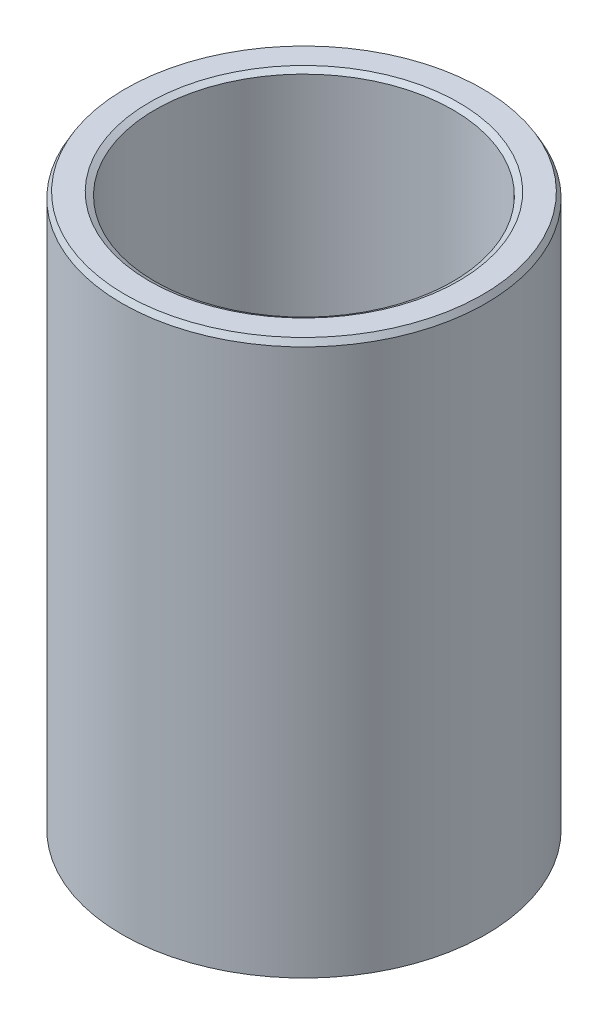
ISO-10303-21;
HEADER;
FILE_DESCRIPTION(('STEP AP214'),'2;1');
FILE_NAME('part.step','',(''),(''),'','','');
FILE_SCHEMA(('AUTOMOTIVE_DESIGN { 1 0 10303 214 1 1 1 1 }'));
ENDSEC;
DATA;
#1=APPLICATION_CONTEXT('core data for automotive mechanical design processes');
#2=APPLICATION_PROTOCOL_DEFINITION('international standard','automotive_design',2000,#1);
#3=PRODUCT_CONTEXT('',#1,'mechanical');
#4=PRODUCT('Part','Part','',(#3));
#5=PRODUCT_RELATED_PRODUCT_CATEGORY('part','',(#4));
#6=PRODUCT_DEFINITION_FORMATION('','',#4);
#7=PRODUCT_DEFINITION_CONTEXT('part definition',#1,'design');
#8=PRODUCT_DEFINITION('design','',#6,#7);
#9=PRODUCT_DEFINITION_SHAPE('','',#8);
#10=(LENGTH_UNIT() NAMED_UNIT(*) SI_UNIT(.MILLI.,.METRE.));
#11=(NAMED_UNIT(*) PLANE_ANGLE_UNIT() SI_UNIT($,.RADIAN.));
#12=(NAMED_UNIT(*) SI_UNIT($,.STERADIAN.) SOLID_ANGLE_UNIT());
#13=UNCERTAINTY_MEASURE_WITH_UNIT(LENGTH_MEASURE(1.E-05),#10,'distance_accuracy_value','');
#14=(GEOMETRIC_REPRESENTATION_CONTEXT(3) GLOBAL_UNCERTAINTY_ASSIGNED_CONTEXT((#13)) GLOBAL_UNIT_ASSIGNED_CONTEXT((#10,
#11,#12)) REPRESENTATION_CONTEXT('',''));
#15=CARTESIAN_POINT('',(0.,0.,0.));
#16=DIRECTION('',(0.,0.,1.));
#17=DIRECTION('',(1.,0.,0.));
#18=AXIS2_PLACEMENT_3D('',#15,#16,#17);
#19=CARTESIAN_POINT('',(0.,129.873883917508,0.));
#20=DIRECTION('',(0.,-1.,0.));
#21=DIRECTION('',(0.,0.,-1.));
#22=AXIS2_PLACEMENT_3D('',#19,#20,#21);
#23=CYLINDRICAL_SURFACE('',#22,42.5);
#24=CARTESIAN_POINT('',(0.,0.78767571603483,0.));
#25=DIRECTION('',(0.,1.,0.));
#26=DIRECTION('',(0.,0.,1.));
#27=AXIS2_PLACEMENT_3D('',#24,#25,#26);
#28=CIRCLE('',#27,42.5);
#29=CARTESIAN_POINT('',(0.,0.78767571603483,42.5));
#30=VERTEX_POINT('',#29);
#31=EDGE_CURVE('E10',#30,#30,#28,.T.);
#32=ORIENTED_EDGE('',*,*,#31,.T.);
#33=EDGE_LOOP('',(#32));
#34=FACE_BOUND('',#33,.T.);
#35=CARTESIAN_POINT('',(0.,128.509589557448,0.));
#36=DIRECTION('',(0.,1.,0.));
#37=DIRECTION('',(0.,0.,1.));
#38=AXIS2_PLACEMENT_3D('',#35,#36,#37);
#39=CIRCLE('',#38,42.5);
#40=CARTESIAN_POINT('',(0.,128.509589557448,42.5));
#41=VERTEX_POINT('',#40);
#42=EDGE_CURVE('E50',#41,#41,#39,.F.);
#43=ORIENTED_EDGE('',*,*,#42,.T.);
#44=EDGE_LOOP('',(#43));
#45=FACE_BOUND('',#44,.T.);
#46=ADVANCED_FACE('F39',(#34,#45),#23,.T.);
#47=CARTESIAN_POINT('',(0.,129.873883917508,0.));
#48=DIRECTION('',(0.,1.,0.));
#49=DIRECTION('',(0.,0.,1.));
#50=AXIS2_PLACEMENT_3D('',#47,#48,#49);
#51=PLANE('',#50);
#52=CARTESIAN_POINT('',(0.,129.873883917508,0.));
#53=DIRECTION('',(0.,1.,0.));
#54=DIRECTION('',(0.,0.,1.));
#55=AXIS2_PLACEMENT_3D('',#52,#53,#54);
#56=CIRCLE('',#55,36.1468698054226);
#57=CARTESIAN_POINT('',(0.,129.873883917508,36.1468698054226));
#58=VERTEX_POINT('',#57);
#59=EDGE_CURVE('E58',#58,#58,#56,.F.);
#60=ORIENTED_EDGE('',*,*,#59,.T.);
#61=EDGE_LOOP('',(#60));
#62=FACE_BOUND('',#61,.T.);
#63=CARTESIAN_POINT('',(0.,129.873883917508,0.));
#64=DIRECTION('',(0.,1.,0.));
#65=DIRECTION('',(0.,0.,1.));
#66=AXIS2_PLACEMENT_3D('',#63,#64,#65);
#67=CIRCLE('',#66,41.7123242839652);
#68=CARTESIAN_POINT('',(0.,129.873883917508,41.7123242839652));
#69=VERTEX_POINT('',#68);
#70=EDGE_CURVE('E61',#69,#69,#67,.T.);
#71=ORIENTED_EDGE('',*,*,#70,.T.);
#72=EDGE_LOOP('',(#71));
#73=FACE_BOUND('',#72,.T.);
#74=ADVANCED_FACE('F88',(#62,#73),#51,.T.);
#75=CARTESIAN_POINT('',(0.,0.,0.));
#76=DIRECTION('',(0.,1.,0.));
#77=DIRECTION('',(0.,0.,1.));
#78=AXIS2_PLACEMENT_3D('',#75,#76,#77);
#79=PLANE('',#78);
#80=CARTESIAN_POINT('',(0.,0.,0.));
#81=DIRECTION('',(0.,1.,0.));
#82=DIRECTION('',(0.,0.,1.));
#83=AXIS2_PLACEMENT_3D('',#80,#81,#82);
#84=CIRCLE('',#83,35.5702511613969);
#85=CARTESIAN_POINT('',(0.,0.,-35.5702511613969));
#86=VERTEX_POINT('',#85);
#87=EDGE_CURVE('E51',#86,#86,#84,.T.);
#88=ORIENTED_EDGE('',*,*,#87,.T.);
#89=EDGE_LOOP('',(#88));
#90=FACE_BOUND('',#89,.T.);
#91=CARTESIAN_POINT('',(0.,0.,0.));
#92=DIRECTION('',(0.,1.,0.));
#93=DIRECTION('',(0.,0.,1.));
#94=AXIS2_PLACEMENT_3D('',#91,#92,#93);
#95=CIRCLE('',#94,41.1357056399395);
#96=CARTESIAN_POINT('',(0.,0.,41.1357056399395));
#97=VERTEX_POINT('',#96);
#98=EDGE_CURVE('E54',#97,#97,#95,.F.);
#99=ORIENTED_EDGE('',*,*,#98,.T.);
#100=EDGE_LOOP('',(#99));
#101=FACE_BOUND('',#100,.T.);
#102=ADVANCED_FACE('F83',(#90,#101),#79,.F.);
#103=CARTESIAN_POINT('',(0.,129.873883917508,0.));
#104=DIRECTION('',(0.,-1.,0.));
#105=DIRECTION('',(0.,0.,-1.));
#106=AXIS2_PLACEMENT_3D('',#103,#104,#105);
#107=CYLINDRICAL_SURFACE('',#106,34.782575445362);
#108=CARTESIAN_POINT('',(0.,129.086208201473,0.));
#109=DIRECTION('',(0.,1.,0.));
#110=DIRECTION('',(0.,0.,1.));
#111=AXIS2_PLACEMENT_3D('',#108,#109,#110);
#112=CIRCLE('',#111,34.782575445362);
#113=CARTESIAN_POINT('',(0.,129.086208201473,34.782575445362));
#114=VERTEX_POINT('',#113);
#115=EDGE_CURVE('E67',#114,#114,#112,.T.);
#116=ORIENTED_EDGE('',*,*,#115,.T.);
#117=EDGE_LOOP('',(#116));
#118=FACE_BOUND('',#117,.T.);
#119=CARTESIAN_POINT('',(0.,1.36429436006055,0.));
#120=DIRECTION('',(0.,1.,0.));
#121=DIRECTION('',(0.,0.,1.));
#122=AXIS2_PLACEMENT_3D('',#119,#120,#121);
#123=CIRCLE('',#122,34.782575445362);
#124=CARTESIAN_POINT('',(0.,1.36429436006055,-34.782575445362));
#125=VERTEX_POINT('',#124);
#126=EDGE_CURVE('E69',#125,#125,#123,.F.);
#127=ORIENTED_EDGE('',*,*,#126,.T.);
#128=EDGE_LOOP('',(#127));
#129=FACE_BOUND('',#128,.T.);
#130=ADVANCED_FACE('F71',(#118,#129),#107,.F.);
#131=CARTESIAN_POINT('',(0.,129.086208201473,0.));
#132=DIRECTION('',(0.,1.,0.));
#133=DIRECTION('',(0.,0.,1.));
#134=AXIS2_PLACEMENT_3D('',#131,#132,#133);
#135=CONICAL_SURFACE('',#134,34.782575445362,1.0471975511966);
#136=ORIENTED_EDGE('',*,*,#59,.F.);
#137=EDGE_LOOP('',(#136));
#138=FACE_BOUND('',#137,.T.);
#139=ORIENTED_EDGE('',*,*,#115,.F.);
#140=EDGE_LOOP('',(#139));
#141=FACE_BOUND('',#140,.T.);
#142=ADVANCED_FACE('F77',(#138,#141),#135,.F.);
#143=CARTESIAN_POINT('',(0.,0.,0.));
#144=DIRECTION('',(0.,-1.,0.));
#145=DIRECTION('',(0.,0.,-1.));
#146=AXIS2_PLACEMENT_3D('',#143,#144,#145);
#147=CONICAL_SURFACE('',#146,35.5702511613969,0.523598775598296);
#148=CARTESIAN_POINT('',(0.,1.36429436006055,-34.782575445362));
#149=CARTESIAN_POINT('',(0.,1.35008296047659,-34.7907804007374));
#150=CARTESIAN_POINT('',(0.,1.33587156089262,-34.7989853561127));
#151=CARTESIAN_POINT('',(0.,1.3074487617247,-34.8153952668635));
#152=CARTESIAN_POINT('',(0.,1.29323736214073,-34.8236002222388));
#153=CARTESIAN_POINT('',(0.,1.2648145629728,-34.8400101329896));
#154=CARTESIAN_POINT('',(0.,1.25060316338884,-34.8482150883649));
#155=CARTESIAN_POINT('',(0.,1.22218036422091,-34.8646249991157));
#156=CARTESIAN_POINT('',(0.,1.20796896463695,-34.872829954491));
#157=CARTESIAN_POINT('',(0.,1.17954616546902,-34.8892398652417));
#158=CARTESIAN_POINT('',(0.,1.16533476588506,-34.8974448206171));
#159=CARTESIAN_POINT('',(0.,1.13691196671713,-34.9138547313678));
#160=CARTESIAN_POINT('',(0.,1.12270056713316,-34.9220596867432));
#161=CARTESIAN_POINT('',(0.,1.09427776796523,-34.9384695974939));
#162=CARTESIAN_POINT('',(0.,1.08006636838127,-34.9466745528693));
#163=CARTESIAN_POINT('',(0.,1.05164356921334,-34.96308446362));
#164=CARTESIAN_POINT('',(0.,1.03743216962938,-34.9712894189954));
#165=CARTESIAN_POINT('',(0.,1.00900937046145,-34.9876993297461));
#166=CARTESIAN_POINT('',(0.,0.994797970877486,-34.9959042851215));
#167=CARTESIAN_POINT('',(0.,0.966375171709558,-35.0123141958722));
#168=CARTESIAN_POINT('',(0.,0.952163772125594,-35.0205191512476));
#169=CARTESIAN_POINT('',(0.,0.923740972957666,-35.0369290619983));
#170=CARTESIAN_POINT('',(0.,0.909529573373701,-35.0451340173736));
#171=CARTESIAN_POINT('',(0.,0.881106774205773,-35.0615439281244));
#172=CARTESIAN_POINT('',(0.,0.86689537462181,-35.0697488834997));
#173=CARTESIAN_POINT('',(0.,0.838472575453882,-35.0861587942505));
#174=CARTESIAN_POINT('',(0.,0.824261175869918,-35.0943637496258));
#175=CARTESIAN_POINT('',(0.,0.795838376701989,-35.1107736603765));
#176=CARTESIAN_POINT('',(0.,0.781626977118024,-35.1189786157519));
#177=CARTESIAN_POINT('',(0.,0.753204177950096,-35.1353885265026));
#178=CARTESIAN_POINT('',(0.,0.738992778366133,-35.143593481878));
#179=CARTESIAN_POINT('',(0.,0.710569979198205,-35.1600033926287));
#180=CARTESIAN_POINT('',(0.,0.696358579614241,-35.1682083480041));
#181=CARTESIAN_POINT('',(0.,0.667935780446312,-35.1846182587548));
#182=CARTESIAN_POINT('',(0.,0.653724380862348,-35.1928232141302));
#183=CARTESIAN_POINT('',(0.,0.62530158169442,-35.2092331248809));
#184=CARTESIAN_POINT('',(0.,0.611090182110456,-35.2174380802563));
#185=CARTESIAN_POINT('',(0.,0.582667382942528,-35.233847991007));
#186=CARTESIAN_POINT('',(0.,0.568455983358564,-35.2420529463824));
#187=CARTESIAN_POINT('',(0.,0.540033184190635,-35.2584628571331));
#188=CARTESIAN_POINT('',(0.,0.525821784606671,-35.2666678125084));
#189=CARTESIAN_POINT('',(0.,0.497398985438743,-35.2830777232592));
#190=CARTESIAN_POINT('',(0.,0.483187585854779,-35.2912826786345));
#191=CARTESIAN_POINT('',(0.,0.454764786686851,-35.3076925893853));
#192=CARTESIAN_POINT('',(0.,0.440553387102887,-35.3158975447606));
#193=CARTESIAN_POINT('',(0.,0.412130587934958,-35.3323074555113));
#194=CARTESIAN_POINT('',(0.,0.397919188350995,-35.3405124108867));
#195=CARTESIAN_POINT('',(0.,0.369496389183066,-35.3569223216374));
#196=CARTESIAN_POINT('',(0.,0.355284989599102,-35.3651272770128));
#197=CARTESIAN_POINT('',(0.,0.326862190431174,-35.3815371877635));
#198=CARTESIAN_POINT('',(0.,0.31265079084721,-35.3897421431389));
#199=CARTESIAN_POINT('',(0.,0.284227991679282,-35.4061520538896));
#200=CARTESIAN_POINT('',(0.,0.270016592095318,-35.414357009265));
#201=CARTESIAN_POINT('',(0.,0.241593792927389,-35.4307669200157));
#202=CARTESIAN_POINT('',(0.,0.227382393343425,-35.4389718753911));
#203=CARTESIAN_POINT('',(0.,0.198959594175497,-35.4553817861418));
#204=CARTESIAN_POINT('',(0.,0.184748194591534,-35.4635867415172));
#205=CARTESIAN_POINT('',(0.,0.156325395423606,-35.4799966522679));
#206=CARTESIAN_POINT('',(0.,0.142113995839641,-35.4882016076432));
#207=CARTESIAN_POINT('',(0.,0.113691196671712,-35.504611518394));
#208=CARTESIAN_POINT('',(0.,0.099479797087748,-35.5128164737693));
#209=CARTESIAN_POINT('',(0.,0.07105699791982,-35.5292263845201));
#210=CARTESIAN_POINT('',(0.,0.0568455983358564,-35.5374313398954));
#211=CARTESIAN_POINT('',(0.,0.0284227991679291,-35.5538412506462));
#212=CARTESIAN_POINT('',(0.,0.0142113995839655,-35.5620462060215));
#213=CARTESIAN_POINT('',(0.,0.,-35.5702511613969));
#214=B_SPLINE_CURVE_WITH_KNOTS('',3,(#148,#149,#150,#151,#152,#153,#154,#155,#156,#157,#158,
#159,#160,#161,#162,#163,#164,#165,#166,#167,#168,#169,#170,#171,#172,#173,#174,#175,#176,#177,
#178,#179,#180,#181,#182,#183,#184,#185,#186,#187,#188,#189,#190,#191,#192,#193,#194,#195,#196,
#197,#198,#199,#200,#201,#202,#203,#204,#205,#206,#207,#208,#209,#210,#211,#212,#213),
.UNSPECIFIED.,.F.,.F.,(4,2,2,2,2,2,2,2,2,2,2,2,2,2,2,2,2,2,2,2,2,2,2,2,2,2,2,2,2,2,2,2,4),(0.,
0.0492297322521769,0.0984594645043572,0.147689196756534,0.196918929008711,0.246148661260891,
0.295378393513068,0.344608125765245,0.393837858017425,0.443067590269602,0.492297322521779,
0.541527054773956,0.590756787026136,0.639986519278313,0.68921625153049,0.73844598378267,
0.787675716034847,0.836905448287024,0.886135180539205,0.935364912791381,0.984594645043558,
1.03382437729574,1.08305410954792,1.13228384180009,1.18151357405227,1.23074330630445,
1.27997303855663,1.3292027708088,1.37843250306098,1.42766223531316,1.47689196756534,
1.52612169981752,1.57535143206969),.UNSPECIFIED.);
#215=EDGE_CURVE('BSEAM73',#125,#86,#214,.T.);
#216=ORIENTED_EDGE('',*,*,#126,.F.);
#217=ORIENTED_EDGE('',*,*,#87,.F.);
#218=ORIENTED_EDGE('',*,*,#215,.T.);
#219=ORIENTED_EDGE('',*,*,#215,.F.);
#220=EDGE_LOOP('',(#216,#218,#217,#219));
#221=FACE_BOUND('',#220,.T.);
#222=ADVANCED_FACE('F73',(#221),#147,.F.);
#223=CARTESIAN_POINT('',(0.,0.78767571603483,0.));
#224=DIRECTION('',(0.,1.,0.));
#225=DIRECTION('',(0.,0.,1.));
#226=AXIS2_PLACEMENT_3D('',#223,#224,#225);
#227=CONICAL_SURFACE('',#226,42.5,1.0471975511966);
#228=ORIENTED_EDGE('',*,*,#98,.F.);
#229=EDGE_LOOP('',(#228));
#230=FACE_BOUND('',#229,.T.);
#231=ORIENTED_EDGE('',*,*,#31,.F.);
#232=EDGE_LOOP('',(#231));
#233=FACE_BOUND('',#232,.T.);
#234=ADVANCED_FACE('F76',(#230,#233),#227,.T.);
#235=CARTESIAN_POINT('',(0.,129.873883917508,0.));
#236=DIRECTION('',(0.,-1.,0.));
#237=DIRECTION('',(0.,0.,-1.));
#238=AXIS2_PLACEMENT_3D('',#235,#236,#237);
#239=CONICAL_SURFACE('',#238,41.7123242839652,0.523598775598298);
#240=ORIENTED_EDGE('',*,*,#42,.F.);
#241=EDGE_LOOP('',(#240));
#242=FACE_BOUND('',#241,.T.);
#243=ORIENTED_EDGE('',*,*,#70,.F.);
#244=EDGE_LOOP('',(#243));
#245=FACE_BOUND('',#244,.T.);
#246=ADVANCED_FACE('F45',(#242,#245),#239,.T.);
#247=CLOSED_SHELL('',(#46,#74,#102,#130,#142,#222,#234,#246));
#248=MANIFOLD_SOLID_BREP('B2',#247);
#249=ADVANCED_BREP_SHAPE_REPRESENTATION('',(#18,#248),#14);
#250=SHAPE_DEFINITION_REPRESENTATION(#9,#249);
ENDSEC;
END-ISO-10303-21;
